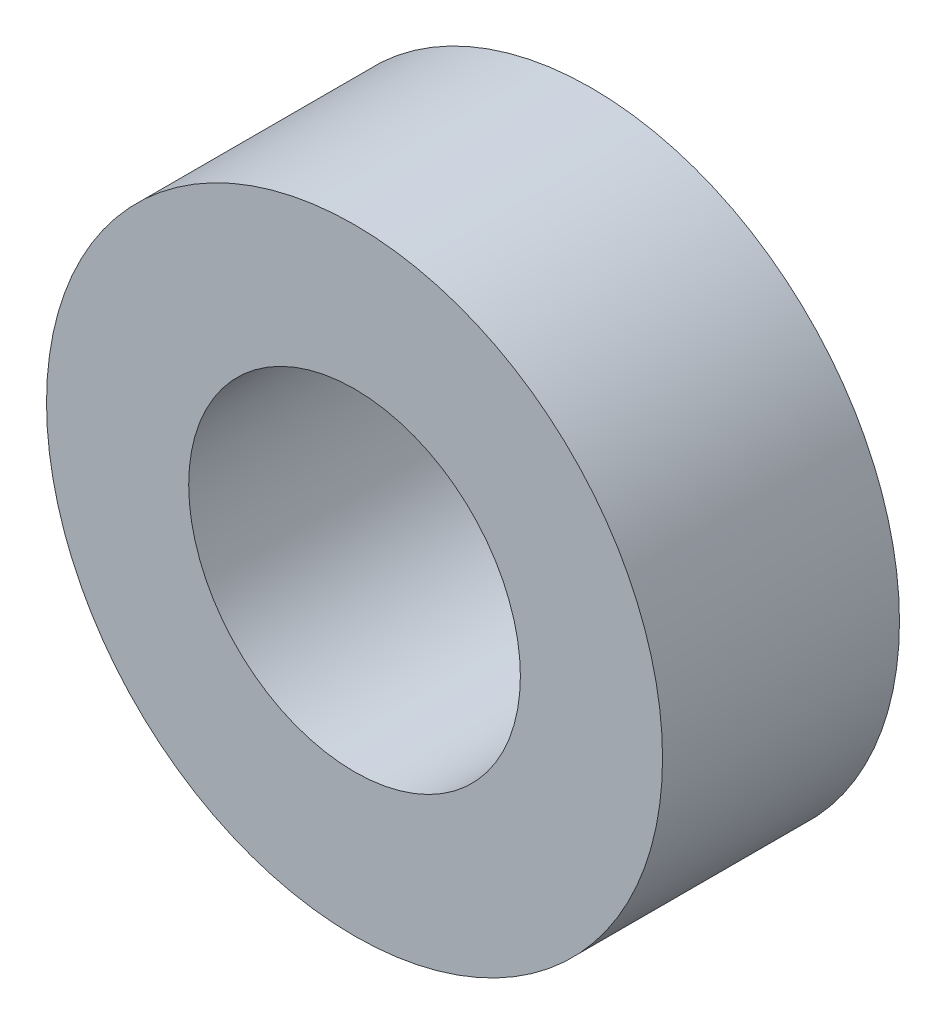
ISO-10303-21;
HEADER;
FILE_DESCRIPTION(('STEP AP214'),'2;1');
FILE_NAME('part.step','',(''),(''),'','','');
FILE_SCHEMA(('AUTOMOTIVE_DESIGN { 1 0 10303 214 1 1 1 1 }'));
ENDSEC;
DATA;
#1=APPLICATION_CONTEXT('core data for automotive mechanical design processes');
#2=APPLICATION_PROTOCOL_DEFINITION('international standard','automotive_design',2000,#1);
#3=PRODUCT_CONTEXT('',#1,'mechanical');
#4=PRODUCT('Part','Part','',(#3));
#5=PRODUCT_RELATED_PRODUCT_CATEGORY('part','',(#4));
#6=PRODUCT_DEFINITION_FORMATION('','',#4);
#7=PRODUCT_DEFINITION_CONTEXT('part definition',#1,'design');
#8=PRODUCT_DEFINITION('design','',#6,#7);
#9=PRODUCT_DEFINITION_SHAPE('','',#8);
#10=(LENGTH_UNIT() NAMED_UNIT(*) SI_UNIT(.MILLI.,.METRE.));
#11=(NAMED_UNIT(*) PLANE_ANGLE_UNIT() SI_UNIT($,.RADIAN.));
#12=(NAMED_UNIT(*) SI_UNIT($,.STERADIAN.) SOLID_ANGLE_UNIT());
#13=UNCERTAINTY_MEASURE_WITH_UNIT(LENGTH_MEASURE(1.E-05),#10,'distance_accuracy_value','');
#14=(GEOMETRIC_REPRESENTATION_CONTEXT(3) GLOBAL_UNCERTAINTY_ASSIGNED_CONTEXT((#13)) GLOBAL_UNIT_ASSIGNED_CONTEXT((#10,
#11,#12)) REPRESENTATION_CONTEXT('',''));
#15=CARTESIAN_POINT('',(0.,0.,0.));
#16=DIRECTION('',(0.,0.,1.));
#17=DIRECTION('',(1.,0.,0.));
#18=AXIS2_PLACEMENT_3D('',#15,#16,#17);
#19=CARTESIAN_POINT('',(0.,0.,5.));
#20=DIRECTION('',(0.,0.,1.));
#21=DIRECTION('',(1.,0.,0.));
#22=AXIS2_PLACEMENT_3D('',#19,#20,#21);
#23=PLANE('',#22);
#24=CARTESIAN_POINT('',(0.,0.,5.));
#25=DIRECTION('',(0.,0.,1.));
#26=DIRECTION('',(1.,0.,0.));
#27=AXIS2_PLACEMENT_3D('',#24,#25,#26);
#28=CIRCLE('',#27,6.5);
#29=CARTESIAN_POINT('',(6.5,0.,5.));
#30=VERTEX_POINT('',#29);
#31=EDGE_CURVE('E10',#30,#30,#28,.T.);
#32=ORIENTED_EDGE('',*,*,#31,.T.);
#33=EDGE_LOOP('',(#32));
#34=FACE_BOUND('',#33,.T.);
#35=CARTESIAN_POINT('',(0.,0.,5.));
#36=DIRECTION('',(0.,0.,1.));
#37=DIRECTION('',(1.,0.,0.));
#38=AXIS2_PLACEMENT_3D('',#35,#36,#37);
#39=CIRCLE('',#38,3.5);
#40=CARTESIAN_POINT('',(3.5,0.,5.));
#41=VERTEX_POINT('',#40);
#42=EDGE_CURVE('E44',#41,#41,#39,.T.);
#43=ORIENTED_EDGE('',*,*,#42,.F.);
#44=EDGE_LOOP('',(#43));
#45=FACE_BOUND('',#44,.T.);
#46=ADVANCED_FACE('F33',(#34,#45),#23,.T.);
#47=CARTESIAN_POINT('',(0.,0.,0.));
#48=DIRECTION('',(0.,0.,1.));
#49=DIRECTION('',(1.,0.,0.));
#50=AXIS2_PLACEMENT_3D('',#47,#48,#49);
#51=PLANE('',#50);
#52=CARTESIAN_POINT('',(0.,0.,0.));
#53=DIRECTION('',(0.,0.,1.));
#54=DIRECTION('',(1.,0.,0.));
#55=AXIS2_PLACEMENT_3D('',#52,#53,#54);
#56=CIRCLE('',#55,6.5);
#57=CARTESIAN_POINT('',(6.5,0.,0.));
#58=VERTEX_POINT('',#57);
#59=EDGE_CURVE('E37',#58,#58,#56,.T.);
#60=ORIENTED_EDGE('',*,*,#59,.F.);
#61=EDGE_LOOP('',(#60));
#62=FACE_BOUND('',#61,.T.);
#63=CARTESIAN_POINT('',(0.,0.,0.));
#64=DIRECTION('',(0.,0.,1.));
#65=DIRECTION('',(1.,0.,0.));
#66=AXIS2_PLACEMENT_3D('',#63,#64,#65);
#67=CIRCLE('',#66,3.5);
#68=CARTESIAN_POINT('',(3.5,0.,0.));
#69=VERTEX_POINT('',#68);
#70=EDGE_CURVE('E46',#69,#69,#67,.T.);
#71=ORIENTED_EDGE('',*,*,#70,.T.);
#72=EDGE_LOOP('',(#71));
#73=FACE_BOUND('',#72,.T.);
#74=ADVANCED_FACE('F56',(#62,#73),#51,.F.);
#75=CARTESIAN_POINT('',(0.,0.,5.));
#76=DIRECTION('',(0.,0.,-1.));
#77=DIRECTION('',(-1.,0.,0.));
#78=AXIS2_PLACEMENT_3D('',#75,#76,#77);
#79=CYLINDRICAL_SURFACE('',#78,6.5);
#80=ORIENTED_EDGE('',*,*,#31,.F.);
#81=EDGE_LOOP('',(#80));
#82=FACE_BOUND('',#81,.T.);
#83=ORIENTED_EDGE('',*,*,#59,.T.);
#84=EDGE_LOOP('',(#83));
#85=FACE_BOUND('',#84,.T.);
#86=ADVANCED_FACE('F35',(#82,#85),#79,.T.);
#87=CARTESIAN_POINT('',(0.,0.,5.));
#88=DIRECTION('',(0.,0.,-1.));
#89=DIRECTION('',(-1.,0.,0.));
#90=AXIS2_PLACEMENT_3D('',#87,#88,#89);
#91=CYLINDRICAL_SURFACE('',#90,3.5);
#92=ORIENTED_EDGE('',*,*,#42,.T.);
#93=EDGE_LOOP('',(#92));
#94=FACE_BOUND('',#93,.T.);
#95=ORIENTED_EDGE('',*,*,#70,.F.);
#96=EDGE_LOOP('',(#95));
#97=FACE_BOUND('',#96,.T.);
#98=ADVANCED_FACE('F52',(#94,#97),#91,.F.);
#99=CLOSED_SHELL('',(#46,#74,#86,#98));
#100=MANIFOLD_SOLID_BREP('B2',#99);
#101=ADVANCED_BREP_SHAPE_REPRESENTATION('',(#18,#100),#14);
#102=SHAPE_DEFINITION_REPRESENTATION(#9,#101);
ENDSEC;
END-ISO-10303-21;
